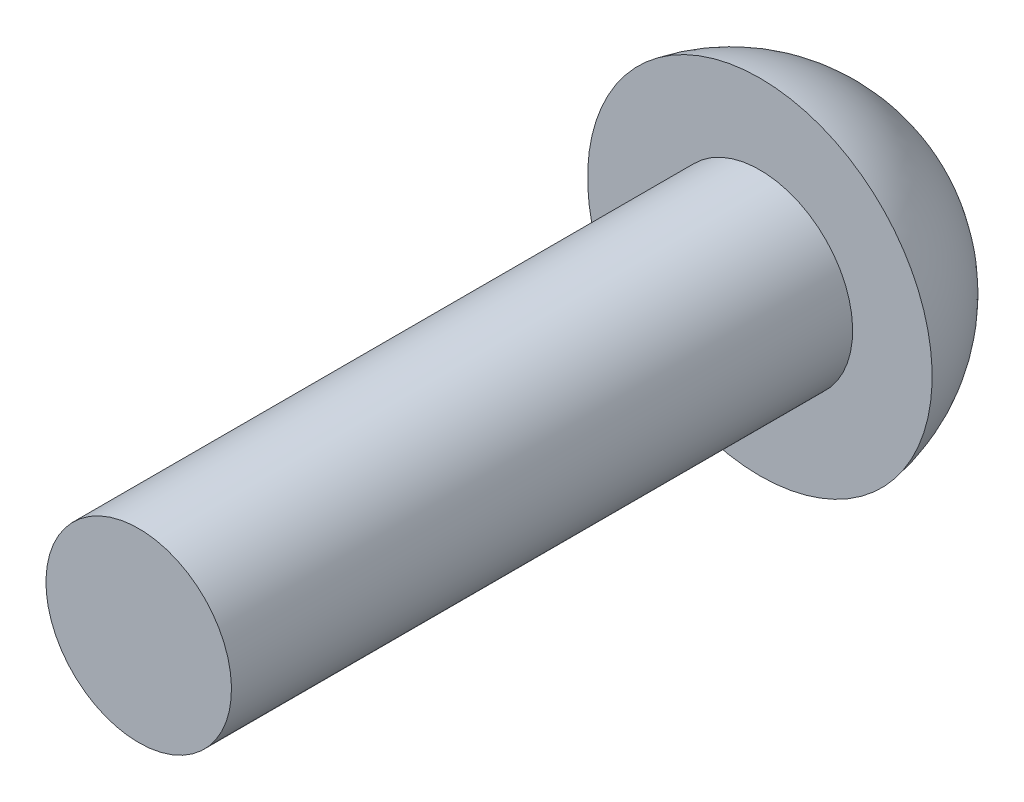
ISO-10303-21;
HEADER;
FILE_DESCRIPTION(('STEP AP214'),'2;1');
FILE_NAME('part.step','',(''),(''),'','','');
FILE_SCHEMA(('AUTOMOTIVE_DESIGN { 1 0 10303 214 1 1 1 1 }'));
ENDSEC;
DATA;
#1=APPLICATION_CONTEXT('core data for automotive mechanical design processes');
#2=APPLICATION_PROTOCOL_DEFINITION('international standard','automotive_design',2000,#1);
#3=PRODUCT_CONTEXT('',#1,'mechanical');
#4=PRODUCT('Part','Part','',(#3));
#5=PRODUCT_RELATED_PRODUCT_CATEGORY('part','',(#4));
#6=PRODUCT_DEFINITION_FORMATION('','',#4);
#7=PRODUCT_DEFINITION_CONTEXT('part definition',#1,'design');
#8=PRODUCT_DEFINITION('design','',#6,#7);
#9=PRODUCT_DEFINITION_SHAPE('','',#8);
#10=(LENGTH_UNIT() NAMED_UNIT(*) SI_UNIT(.MILLI.,.METRE.));
#11=(NAMED_UNIT(*) PLANE_ANGLE_UNIT() SI_UNIT($,.RADIAN.));
#12=(NAMED_UNIT(*) SI_UNIT($,.STERADIAN.) SOLID_ANGLE_UNIT());
#13=UNCERTAINTY_MEASURE_WITH_UNIT(LENGTH_MEASURE(1.E-05),#10,'distance_accuracy_value','');
#14=(GEOMETRIC_REPRESENTATION_CONTEXT(3) GLOBAL_UNCERTAINTY_ASSIGNED_CONTEXT((#13)) GLOBAL_UNIT_ASSIGNED_CONTEXT((#10,
#11,#12)) REPRESENTATION_CONTEXT('',''));
#15=CARTESIAN_POINT('',(0.,0.,0.));
#16=DIRECTION('',(0.,0.,1.));
#17=DIRECTION('',(1.,0.,0.));
#18=AXIS2_PLACEMENT_3D('',#15,#16,#17);
#19=CARTESIAN_POINT('',(0.,0.,-9.08165454545455));
#20=DIRECTION('',(0.,0.,1.));
#21=DIRECTION('',(0.,1.,0.));
#22=AXIS2_PLACEMENT_3D('',#19,#20,#21);
#23=SPHERICAL_SURFACE('',#22,2.67854545454545);
#24=CARTESIAN_POINT('',(0.,0.,-9.525));
#25=DIRECTION('',(0.,0.,1.));
#26=DIRECTION('',(0.,-1.,0.));
#27=AXIS2_PLACEMENT_3D('',#24,#25,#26);
#28=CIRCLE('',#27,2.6416);
#29=CARTESIAN_POINT('',(0.,-2.6416,-9.525));
#30=VERTEX_POINT('',#29);
#31=EDGE_CURVE('E10',#30,#30,#28,.T.);
#32=ORIENTED_EDGE('',*,*,#31,.F.);
#33=EDGE_LOOP('',(#32));
#34=FACE_BOUND('',#33,.T.);
#35=ADVANCED_FACE('F358',(#34),#23,.T.);
#36=CARTESIAN_POINT('',(0.,1.4224,-9.525));
#37=DIRECTION('',(0.,0.,-1.));
#38=DIRECTION('',(0.,1.,0.));
#39=AXIS2_PLACEMENT_3D('',#36,#37,#38);
#40=PLANE('',#39);
#41=CARTESIAN_POINT('',(0.,0.,-9.525));
#42=DIRECTION('',(0.,0.,1.));
#43=DIRECTION('',(0.,-1.,0.));
#44=AXIS2_PLACEMENT_3D('',#41,#42,#43);
#45=CIRCLE('',#44,1.4224);
#46=CARTESIAN_POINT('',(0.,-1.4224,-9.525));
#47=VERTEX_POINT('',#46);
#48=EDGE_CURVE('E364',#47,#47,#45,.T.);
#49=ORIENTED_EDGE('',*,*,#48,.F.);
#50=EDGE_LOOP('',(#49));
#51=FACE_BOUND('',#50,.T.);
#52=ORIENTED_EDGE('',*,*,#31,.T.);
#53=EDGE_LOOP('',(#52));
#54=FACE_BOUND('',#53,.T.);
#55=ADVANCED_FACE('F379',(#51,#54),#40,.F.);
#56=CARTESIAN_POINT('',(0.,0.,0.));
#57=DIRECTION('',(0.,0.,1.));
#58=DIRECTION('',(0.,-1.,0.));
#59=AXIS2_PLACEMENT_3D('',#56,#57,#58);
#60=CYLINDRICAL_SURFACE('',#59,1.4224);
#61=CARTESIAN_POINT('',(0.,0.,0.));
#62=DIRECTION('',(0.,0.,1.));
#63=DIRECTION('',(0.,-1.,0.));
#64=AXIS2_PLACEMENT_3D('',#61,#62,#63);
#65=CIRCLE('',#64,1.4224);
#66=CARTESIAN_POINT('',(0.,-1.4224,0.));
#67=VERTEX_POINT('',#66);
#68=EDGE_CURVE('E368',#67,#67,#65,.T.);
#69=ORIENTED_EDGE('',*,*,#68,.F.);
#70=EDGE_LOOP('',(#69));
#71=FACE_BOUND('',#70,.T.);
#72=ORIENTED_EDGE('',*,*,#48,.T.);
#73=EDGE_LOOP('',(#72));
#74=FACE_BOUND('',#73,.T.);
#75=ADVANCED_FACE('F377',(#71,#74),#60,.T.);
#76=CARTESIAN_POINT('',(0.,0.,0.));
#77=DIRECTION('',(0.,0.,-1.));
#78=DIRECTION('',(0.,1.,0.));
#79=AXIS2_PLACEMENT_3D('',#76,#77,#78);
#80=PLANE('',#79);
#81=ORIENTED_EDGE('',*,*,#68,.T.);
#82=EDGE_LOOP('',(#81));
#83=FACE_BOUND('',#82,.T.);
#84=ADVANCED_FACE('F375',(#83),#80,.F.);
#85=CLOSED_SHELL('',(#35,#55,#75,#84));
#86=MANIFOLD_SOLID_BREP('B2',#85);
#87=ADVANCED_BREP_SHAPE_REPRESENTATION('',(#18,#86),#14);
#88=SHAPE_DEFINITION_REPRESENTATION(#9,#87);
ENDSEC;
END-ISO-10303-21;
